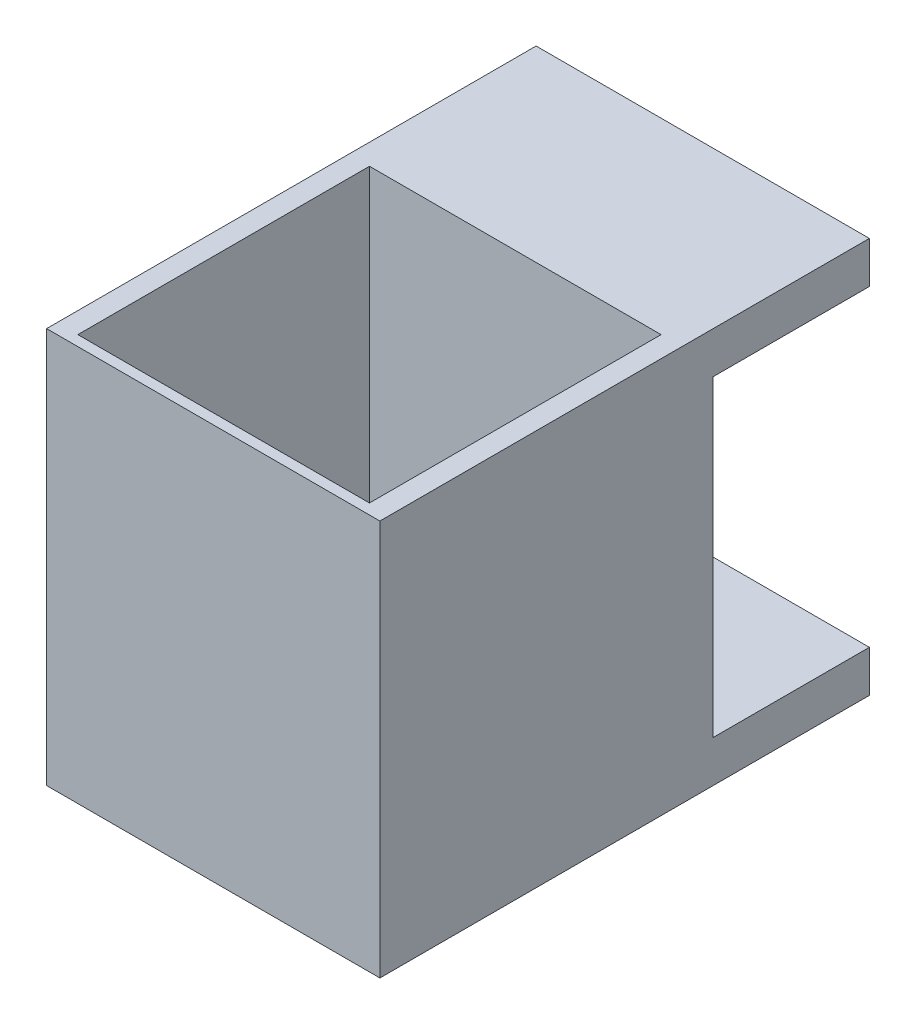
ISO-10303-21;
HEADER;
FILE_DESCRIPTION(('STEP AP214'),'2;1');
FILE_NAME('part.step','',(''),(''),'','','');
FILE_SCHEMA(('AUTOMOTIVE_DESIGN { 1 0 10303 214 1 1 1 1 }'));
ENDSEC;
DATA;
#1=APPLICATION_CONTEXT('core data for automotive mechanical design processes');
#2=APPLICATION_PROTOCOL_DEFINITION('international standard','automotive_design',2000,#1);
#3=PRODUCT_CONTEXT('',#1,'mechanical');
#4=PRODUCT('Part','Part','',(#3));
#5=PRODUCT_RELATED_PRODUCT_CATEGORY('part','',(#4));
#6=PRODUCT_DEFINITION_FORMATION('','',#4);
#7=PRODUCT_DEFINITION_CONTEXT('part definition',#1,'design');
#8=PRODUCT_DEFINITION('design','',#6,#7);
#9=PRODUCT_DEFINITION_SHAPE('','',#8);
#10=(LENGTH_UNIT() NAMED_UNIT(*) SI_UNIT(.MILLI.,.METRE.));
#11=(NAMED_UNIT(*) PLANE_ANGLE_UNIT() SI_UNIT($,.RADIAN.));
#12=(NAMED_UNIT(*) SI_UNIT($,.STERADIAN.) SOLID_ANGLE_UNIT());
#13=UNCERTAINTY_MEASURE_WITH_UNIT(LENGTH_MEASURE(1.E-05),#10,'distance_accuracy_value','');
#14=(GEOMETRIC_REPRESENTATION_CONTEXT(3) GLOBAL_UNCERTAINTY_ASSIGNED_CONTEXT((#13)) GLOBAL_UNIT_ASSIGNED_CONTEXT((#10,
#11,#12)) REPRESENTATION_CONTEXT('',''));
#15=CARTESIAN_POINT('',(0.,0.,0.));
#16=DIRECTION('',(0.,0.,1.));
#17=DIRECTION('',(1.,0.,0.));
#18=AXIS2_PLACEMENT_3D('',#15,#16,#17);
#19=CARTESIAN_POINT('',(16.,0.,-47.));
#20=DIRECTION('',(0.,1.,0.));
#21=DIRECTION('',(0.,0.,1.));
#22=AXIS2_PLACEMENT_3D('',#19,#20,#21);
#23=PLANE('',#22);
#24=DIRECTION('',(-1.,0.,0.));
#25=VECTOR('',#24,1.);
#26=CARTESIAN_POINT('',(-14.,0.,-29.));
#27=LINE('',#26,#25);
#28=CARTESIAN_POINT('',(14.,0.,-29.));
#29=VERTEX_POINT('',#28);
#30=CARTESIAN_POINT('',(-14.,0.,-29.));
#31=VERTEX_POINT('',#30);
#32=EDGE_CURVE('E128',#29,#31,#27,.T.);
#33=ORIENTED_EDGE('',*,*,#32,.T.);
#34=DIRECTION('',(0.,0.,1.));
#35=VECTOR('',#34,1.);
#36=CARTESIAN_POINT('',(-14.,0.,-29.));
#37=LINE('',#36,#35);
#38=CARTESIAN_POINT('',(-14.,0.,-1.));
#39=VERTEX_POINT('',#38);
#40=EDGE_CURVE('E122',#31,#39,#37,.T.);
#41=ORIENTED_EDGE('',*,*,#40,.T.);
#42=DIRECTION('',(1.,0.,0.));
#43=VECTOR('',#42,1.);
#44=CARTESIAN_POINT('',(-14.,0.,-1.));
#45=LINE('',#44,#43);
#46=CARTESIAN_POINT('',(14.,0.,-1.));
#47=VERTEX_POINT('',#46);
#48=EDGE_CURVE('E131',#39,#47,#45,.T.);
#49=ORIENTED_EDGE('',*,*,#48,.T.);
#50=DIRECTION('',(0.,0.,-1.));
#51=VECTOR('',#50,1.);
#52=CARTESIAN_POINT('',(14.,0.,-29.));
#53=LINE('',#52,#51);
#54=EDGE_CURVE('E46',#47,#29,#53,.T.);
#55=ORIENTED_EDGE('',*,*,#54,.T.);
#56=EDGE_LOOP('',(#33,#41,#49,#55));
#57=FACE_BOUND('',#56,.T.);
#58=DIRECTION('',(0.,0.,-1.));
#59=VECTOR('',#58,1.);
#60=CARTESIAN_POINT('',(-16.,0.,-47.));
#61=LINE('',#60,#59);
#62=CARTESIAN_POINT('',(-16.,0.,0.));
#63=VERTEX_POINT('',#62);
#64=CARTESIAN_POINT('',(-16.,0.,-47.));
#65=VERTEX_POINT('',#64);
#66=EDGE_CURVE('E156',#63,#65,#61,.T.);
#67=ORIENTED_EDGE('',*,*,#66,.T.);
#68=DIRECTION('',(-1.,0.,0.));
#69=VECTOR('',#68,1.);
#70=CARTESIAN_POINT('',(16.,0.,-47.));
#71=LINE('',#70,#69);
#72=CARTESIAN_POINT('',(16.,0.,-47.));
#73=VERTEX_POINT('',#72);
#74=EDGE_CURVE('E11',#73,#65,#71,.T.);
#75=ORIENTED_EDGE('',*,*,#74,.F.);
#76=DIRECTION('',(0.,0.,-1.));
#77=VECTOR('',#76,1.);
#78=CARTESIAN_POINT('',(16.,0.,-47.));
#79=LINE('',#78,#77);
#80=CARTESIAN_POINT('',(16.,0.,0.));
#81=VERTEX_POINT('',#80);
#82=EDGE_CURVE('E160',#81,#73,#79,.T.);
#83=ORIENTED_EDGE('',*,*,#82,.F.);
#84=DIRECTION('',(-1.,0.,0.));
#85=VECTOR('',#84,1.);
#86=CARTESIAN_POINT('',(16.,0.,0.));
#87=LINE('',#86,#85);
#88=EDGE_CURVE('E178',#81,#63,#87,.T.);
#89=ORIENTED_EDGE('',*,*,#88,.T.);
#90=EDGE_LOOP('',(#67,#75,#83,#89));
#91=FACE_BOUND('',#90,.T.);
#92=ADVANCED_FACE('F32',(#57,#91),#23,.F.);
#93=CARTESIAN_POINT('',(16.,4.,-47.));
#94=DIRECTION('',(0.,0.,1.));
#95=DIRECTION('',(1.,0.,0.));
#96=AXIS2_PLACEMENT_3D('',#93,#94,#95);
#97=PLANE('',#96);
#98=CARTESIAN_POINT('',(0.,2.00000000000008,-47.0000000000001));
#99=DIRECTION('',(0.,0.,-1.));
#100=DIRECTION('',(-1.,0.,0.));
#101=AXIS2_PLACEMENT_3D('',#98,#99,#100);
#102=CIRCLE('',#101,1.);
#103=CARTESIAN_POINT('',(-1.,2.00000000000008,-47.0000000000001));
#104=VERTEX_POINT('',#103);
#105=EDGE_CURVE('E407',#104,#104,#102,.T.);
#106=ORIENTED_EDGE('',*,*,#105,.F.);
#107=EDGE_LOOP('',(#106));
#108=FACE_BOUND('',#107,.T.);
#109=DIRECTION('',(0.,1.,0.));
#110=VECTOR('',#109,1.);
#111=CARTESIAN_POINT('',(-16.,4.,-47.));
#112=LINE('',#111,#110);
#113=CARTESIAN_POINT('',(-16.,4.,-47.));
#114=VERTEX_POINT('',#113);
#115=EDGE_CURVE('E181',#65,#114,#112,.T.);
#116=ORIENTED_EDGE('',*,*,#115,.T.);
#117=DIRECTION('',(-1.,0.,0.));
#118=VECTOR('',#117,1.);
#119=CARTESIAN_POINT('',(16.,4.,-47.));
#120=LINE('',#119,#118);
#121=CARTESIAN_POINT('',(16.,4.,-47.));
#122=VERTEX_POINT('',#121);
#123=EDGE_CURVE('E39',#122,#114,#120,.T.);
#124=ORIENTED_EDGE('',*,*,#123,.F.);
#125=DIRECTION('',(0.,1.,0.));
#126=VECTOR('',#125,1.);
#127=CARTESIAN_POINT('',(16.,4.,-47.));
#128=LINE('',#127,#126);
#129=EDGE_CURVE('E163',#73,#122,#128,.T.);
#130=ORIENTED_EDGE('',*,*,#129,.F.);
#131=ORIENTED_EDGE('',*,*,#74,.T.);
#132=EDGE_LOOP('',(#116,#124,#130,#131));
#133=FACE_BOUND('',#132,.T.);
#134=ADVANCED_FACE('F238',(#108,#133),#97,.F.);
#135=CARTESIAN_POINT('',(16.,4.,-32.));
#136=DIRECTION('',(0.,-1.,0.));
#137=DIRECTION('',(0.,0.,-1.));
#138=AXIS2_PLACEMENT_3D('',#135,#136,#137);
#139=PLANE('',#138);
#140=DIRECTION('',(0.,0.,1.));
#141=VECTOR('',#140,1.);
#142=CARTESIAN_POINT('',(-16.,4.,-32.));
#143=LINE('',#142,#141);
#144=CARTESIAN_POINT('',(-16.,4.,-32.));
#145=VERTEX_POINT('',#144);
#146=EDGE_CURVE('E183',#114,#145,#143,.T.);
#147=ORIENTED_EDGE('',*,*,#146,.T.);
#148=DIRECTION('',(-1.,0.,0.));
#149=VECTOR('',#148,1.);
#150=CARTESIAN_POINT('',(16.,4.,-32.));
#151=LINE('',#150,#149);
#152=CARTESIAN_POINT('',(16.,4.,-32.));
#153=VERTEX_POINT('',#152);
#154=EDGE_CURVE('E208',#153,#145,#151,.T.);
#155=ORIENTED_EDGE('',*,*,#154,.F.);
#156=DIRECTION('',(0.,0.,1.));
#157=VECTOR('',#156,1.);
#158=CARTESIAN_POINT('',(16.,4.,-32.));
#159=LINE('',#158,#157);
#160=EDGE_CURVE('E166',#122,#153,#159,.T.);
#161=ORIENTED_EDGE('',*,*,#160,.F.);
#162=ORIENTED_EDGE('',*,*,#123,.T.);
#163=EDGE_LOOP('',(#147,#155,#161,#162));
#164=FACE_BOUND('',#163,.T.);
#165=ADVANCED_FACE('F215',(#164),#139,.F.);
#166=CARTESIAN_POINT('',(16.,34.,-32.));
#167=DIRECTION('',(0.,0.,1.));
#168=DIRECTION('',(1.,0.,0.));
#169=AXIS2_PLACEMENT_3D('',#166,#167,#168);
#170=PLANE('',#169);
#171=DIRECTION('',(0.,1.,0.));
#172=VECTOR('',#171,1.);
#173=CARTESIAN_POINT('',(-16.,34.,-32.));
#174=LINE('',#173,#172);
#175=CARTESIAN_POINT('',(-16.,34.,-32.));
#176=VERTEX_POINT('',#175);
#177=EDGE_CURVE('E185',#145,#176,#174,.T.);
#178=ORIENTED_EDGE('',*,*,#177,.T.);
#179=DIRECTION('',(-1.,0.,0.));
#180=VECTOR('',#179,1.);
#181=CARTESIAN_POINT('',(16.,34.,-32.));
#182=LINE('',#181,#180);
#183=CARTESIAN_POINT('',(16.,34.,-32.));
#184=VERTEX_POINT('',#183);
#185=EDGE_CURVE('E205',#184,#176,#182,.T.);
#186=ORIENTED_EDGE('',*,*,#185,.F.);
#187=DIRECTION('',(0.,1.,0.));
#188=VECTOR('',#187,1.);
#189=CARTESIAN_POINT('',(16.,34.,-32.));
#190=LINE('',#189,#188);
#191=EDGE_CURVE('E168',#153,#184,#190,.T.);
#192=ORIENTED_EDGE('',*,*,#191,.F.);
#193=ORIENTED_EDGE('',*,*,#154,.T.);
#194=EDGE_LOOP('',(#178,#186,#192,#193));
#195=FACE_BOUND('',#194,.T.);
#196=ADVANCED_FACE('F226',(#195),#170,.F.);
#197=CARTESIAN_POINT('',(16.,34.,-47.));
#198=DIRECTION('',(0.,1.,0.));
#199=DIRECTION('',(0.,0.,1.));
#200=AXIS2_PLACEMENT_3D('',#197,#198,#199);
#201=PLANE('',#200);
#202=DIRECTION('',(0.,0.,-1.));
#203=VECTOR('',#202,1.);
#204=CARTESIAN_POINT('',(-16.,34.,-47.));
#205=LINE('',#204,#203);
#206=CARTESIAN_POINT('',(-16.,34.,-47.));
#207=VERTEX_POINT('',#206);
#208=EDGE_CURVE('E187',#176,#207,#205,.T.);
#209=ORIENTED_EDGE('',*,*,#208,.T.);
#210=DIRECTION('',(-1.,0.,0.));
#211=VECTOR('',#210,1.);
#212=CARTESIAN_POINT('',(16.,34.,-47.));
#213=LINE('',#212,#211);
#214=CARTESIAN_POINT('',(16.,34.,-47.));
#215=VERTEX_POINT('',#214);
#216=EDGE_CURVE('E202',#215,#207,#213,.T.);
#217=ORIENTED_EDGE('',*,*,#216,.F.);
#218=DIRECTION('',(0.,0.,-1.));
#219=VECTOR('',#218,1.);
#220=CARTESIAN_POINT('',(16.,34.,-47.));
#221=LINE('',#220,#219);
#222=EDGE_CURVE('E170',#184,#215,#221,.T.);
#223=ORIENTED_EDGE('',*,*,#222,.F.);
#224=ORIENTED_EDGE('',*,*,#185,.T.);
#225=EDGE_LOOP('',(#209,#217,#223,#224));
#226=FACE_BOUND('',#225,.T.);
#227=ADVANCED_FACE('F230',(#226),#201,.F.);
#228=CARTESIAN_POINT('',(16.,38.,-47.));
#229=DIRECTION('',(0.,0.,1.));
#230=DIRECTION('',(0.,-1.,0.));
#231=AXIS2_PLACEMENT_3D('',#228,#229,#230);
#232=PLANE('',#231);
#233=CARTESIAN_POINT('',(0.,36.0000000000001,-47.0000000000001));
#234=DIRECTION('',(0.,0.,-1.));
#235=DIRECTION('',(-1.,0.,0.));
#236=AXIS2_PLACEMENT_3D('',#233,#234,#235);
#237=CIRCLE('',#236,1.);
#238=CARTESIAN_POINT('',(-1.,36.0000000000001,-47.0000000000001));
#239=VERTEX_POINT('',#238);
#240=EDGE_CURVE('E143',#239,#239,#237,.T.);
#241=ORIENTED_EDGE('',*,*,#240,.F.);
#242=EDGE_LOOP('',(#241));
#243=FACE_BOUND('',#242,.T.);
#244=DIRECTION('',(0.,1.,0.));
#245=VECTOR('',#244,1.);
#246=CARTESIAN_POINT('',(-16.,38.,-47.));
#247=LINE('',#246,#245);
#248=CARTESIAN_POINT('',(-16.,38.,-47.));
#249=VERTEX_POINT('',#248);
#250=EDGE_CURVE('E189',#207,#249,#247,.T.);
#251=ORIENTED_EDGE('',*,*,#250,.T.);
#252=DIRECTION('',(-1.,0.,0.));
#253=VECTOR('',#252,1.);
#254=CARTESIAN_POINT('',(16.,38.,-47.));
#255=LINE('',#254,#253);
#256=CARTESIAN_POINT('',(16.,38.,-47.));
#257=VERTEX_POINT('',#256);
#258=EDGE_CURVE('E199',#257,#249,#255,.T.);
#259=ORIENTED_EDGE('',*,*,#258,.F.);
#260=DIRECTION('',(0.,1.,0.));
#261=VECTOR('',#260,1.);
#262=CARTESIAN_POINT('',(16.,38.,-47.));
#263=LINE('',#262,#261);
#264=EDGE_CURVE('E172',#215,#257,#263,.T.);
#265=ORIENTED_EDGE('',*,*,#264,.F.);
#266=ORIENTED_EDGE('',*,*,#216,.T.);
#267=EDGE_LOOP('',(#251,#259,#265,#266));
#268=FACE_BOUND('',#267,.T.);
#269=ADVANCED_FACE('F250',(#243,#268),#232,.F.);
#270=CARTESIAN_POINT('',(16.,38.,0.));
#271=DIRECTION('',(0.,-1.,0.));
#272=DIRECTION('',(0.,0.,-1.));
#273=AXIS2_PLACEMENT_3D('',#270,#271,#272);
#274=PLANE('',#273);
#275=DIRECTION('',(1.,0.,0.));
#276=VECTOR('',#275,1.);
#277=CARTESIAN_POINT('',(-14.,38.,-1.));
#278=LINE('',#277,#276);
#279=CARTESIAN_POINT('',(-14.,38.,-1.));
#280=VERTEX_POINT('',#279);
#281=CARTESIAN_POINT('',(14.,38.,-1.));
#282=VERTEX_POINT('',#281);
#283=EDGE_CURVE('E149',#280,#282,#278,.T.);
#284=ORIENTED_EDGE('',*,*,#283,.F.);
#285=DIRECTION('',(0.,0.,1.));
#286=VECTOR('',#285,1.);
#287=CARTESIAN_POINT('',(-14.,38.,-29.));
#288=LINE('',#287,#286);
#289=CARTESIAN_POINT('',(-14.,38.,-29.));
#290=VERTEX_POINT('',#289);
#291=EDGE_CURVE('E54',#290,#280,#288,.T.);
#292=ORIENTED_EDGE('',*,*,#291,.F.);
#293=DIRECTION('',(-1.,0.,0.));
#294=VECTOR('',#293,1.);
#295=CARTESIAN_POINT('',(-14.,38.,-29.));
#296=LINE('',#295,#294);
#297=CARTESIAN_POINT('',(14.,38.,-29.));
#298=VERTEX_POINT('',#297);
#299=EDGE_CURVE('E137',#298,#290,#296,.T.);
#300=ORIENTED_EDGE('',*,*,#299,.F.);
#301=DIRECTION('',(0.,0.,-1.));
#302=VECTOR('',#301,1.);
#303=CARTESIAN_POINT('',(14.,38.,-29.));
#304=LINE('',#303,#302);
#305=EDGE_CURVE('E140',#282,#298,#304,.T.);
#306=ORIENTED_EDGE('',*,*,#305,.F.);
#307=EDGE_LOOP('',(#284,#292,#300,#306));
#308=FACE_BOUND('',#307,.T.);
#309=DIRECTION('',(0.,0.,1.));
#310=VECTOR('',#309,1.);
#311=CARTESIAN_POINT('',(-16.,38.,0.));
#312=LINE('',#311,#310);
#313=CARTESIAN_POINT('',(-16.,38.,0.));
#314=VERTEX_POINT('',#313);
#315=EDGE_CURVE('E191',#249,#314,#312,.T.);
#316=ORIENTED_EDGE('',*,*,#315,.T.);
#317=DIRECTION('',(-1.,0.,0.));
#318=VECTOR('',#317,1.);
#319=CARTESIAN_POINT('',(16.,38.,0.));
#320=LINE('',#319,#318);
#321=CARTESIAN_POINT('',(16.,38.,0.));
#322=VERTEX_POINT('',#321);
#323=EDGE_CURVE('E196',#322,#314,#320,.T.);
#324=ORIENTED_EDGE('',*,*,#323,.F.);
#325=DIRECTION('',(0.,0.,1.));
#326=VECTOR('',#325,1.);
#327=CARTESIAN_POINT('',(16.,38.,0.));
#328=LINE('',#327,#326);
#329=EDGE_CURVE('E174',#257,#322,#328,.T.);
#330=ORIENTED_EDGE('',*,*,#329,.F.);
#331=ORIENTED_EDGE('',*,*,#258,.T.);
#332=EDGE_LOOP('',(#316,#324,#330,#331));
#333=FACE_BOUND('',#332,.T.);
#334=ADVANCED_FACE('F248',(#308,#333),#274,.F.);
#335=CARTESIAN_POINT('',(16.,0.,0.));
#336=DIRECTION('',(0.,0.,-1.));
#337=DIRECTION('',(-1.,0.,0.));
#338=AXIS2_PLACEMENT_3D('',#335,#336,#337);
#339=PLANE('',#338);
#340=DIRECTION('',(0.,-1.,0.));
#341=VECTOR('',#340,1.);
#342=CARTESIAN_POINT('',(-16.,0.,0.));
#343=LINE('',#342,#341);
#344=EDGE_CURVE('E164',#314,#63,#343,.T.);
#345=ORIENTED_EDGE('',*,*,#344,.T.);
#346=ORIENTED_EDGE('',*,*,#88,.F.);
#347=DIRECTION('',(0.,-1.,0.));
#348=VECTOR('',#347,1.);
#349=CARTESIAN_POINT('',(16.,0.,0.));
#350=LINE('',#349,#348);
#351=EDGE_CURVE('E176',#322,#81,#350,.T.);
#352=ORIENTED_EDGE('',*,*,#351,.F.);
#353=ORIENTED_EDGE('',*,*,#323,.T.);
#354=EDGE_LOOP('',(#345,#346,#352,#353));
#355=FACE_BOUND('',#354,.T.);
#356=ADVANCED_FACE('F243',(#355),#339,.F.);
#357=CARTESIAN_POINT('',(16.,0.,0.));
#358=DIRECTION('',(-1.,0.,0.));
#359=DIRECTION('',(0.,0.,1.));
#360=AXIS2_PLACEMENT_3D('',#357,#358,#359);
#361=PLANE('',#360);
#362=ORIENTED_EDGE('',*,*,#82,.T.);
#363=ORIENTED_EDGE('',*,*,#129,.T.);
#364=ORIENTED_EDGE('',*,*,#160,.T.);
#365=ORIENTED_EDGE('',*,*,#191,.T.);
#366=ORIENTED_EDGE('',*,*,#222,.T.);
#367=ORIENTED_EDGE('',*,*,#264,.T.);
#368=ORIENTED_EDGE('',*,*,#329,.T.);
#369=ORIENTED_EDGE('',*,*,#351,.T.);
#370=EDGE_LOOP('',(#362,#363,#364,#365,#366,#367,#368,#369));
#371=FACE_BOUND('',#370,.T.);
#372=ADVANCED_FACE('F234',(#371),#361,.F.);
#373=CARTESIAN_POINT('',(-16.,0.,0.));
#374=DIRECTION('',(-1.,0.,0.));
#375=DIRECTION('',(0.,0.,1.));
#376=AXIS2_PLACEMENT_3D('',#373,#374,#375);
#377=PLANE('',#376);
#378=ORIENTED_EDGE('',*,*,#66,.F.);
#379=ORIENTED_EDGE('',*,*,#344,.F.);
#380=ORIENTED_EDGE('',*,*,#315,.F.);
#381=ORIENTED_EDGE('',*,*,#250,.F.);
#382=ORIENTED_EDGE('',*,*,#208,.F.);
#383=ORIENTED_EDGE('',*,*,#177,.F.);
#384=ORIENTED_EDGE('',*,*,#146,.F.);
#385=ORIENTED_EDGE('',*,*,#115,.F.);
#386=EDGE_LOOP('',(#378,#379,#380,#381,#382,#383,#384,#385));
#387=FACE_BOUND('',#386,.T.);
#388=ADVANCED_FACE('F221',(#387),#377,.T.);
#389=CARTESIAN_POINT('',(-14.,0.,-29.));
#390=DIRECTION('',(-1.,0.,0.));
#391=DIRECTION('',(0.,0.,1.));
#392=AXIS2_PLACEMENT_3D('',#389,#390,#391);
#393=PLANE('',#392);
#394=ORIENTED_EDGE('',*,*,#291,.T.);
#395=DIRECTION('',(0.,1.,0.));
#396=VECTOR('',#395,1.);
#397=CARTESIAN_POINT('',(-14.,0.,-1.));
#398=LINE('',#397,#396);
#399=EDGE_CURVE('E118',#39,#280,#398,.T.);
#400=ORIENTED_EDGE('',*,*,#399,.F.);
#401=ORIENTED_EDGE('',*,*,#40,.F.);
#402=DIRECTION('',(0.,1.,0.));
#403=VECTOR('',#402,1.);
#404=CARTESIAN_POINT('',(-14.,0.,-29.));
#405=LINE('',#404,#403);
#406=EDGE_CURVE('E154',#31,#290,#405,.T.);
#407=ORIENTED_EDGE('',*,*,#406,.T.);
#408=EDGE_LOOP('',(#394,#400,#401,#407));
#409=FACE_BOUND('',#408,.T.);
#410=ADVANCED_FACE('F120',(#409),#393,.F.);
#411=CARTESIAN_POINT('',(-14.,0.,-29.));
#412=DIRECTION('',(0.,0.,-1.));
#413=DIRECTION('',(-1.,0.,0.));
#414=AXIS2_PLACEMENT_3D('',#411,#412,#413);
#415=PLANE('',#414);
#416=ORIENTED_EDGE('',*,*,#299,.T.);
#417=ORIENTED_EDGE('',*,*,#406,.F.);
#418=ORIENTED_EDGE('',*,*,#32,.F.);
#419=DIRECTION('',(0.,1.,0.));
#420=VECTOR('',#419,1.);
#421=CARTESIAN_POINT('',(14.,0.,-29.));
#422=LINE('',#421,#420);
#423=EDGE_CURVE('E157',#29,#298,#422,.T.);
#424=ORIENTED_EDGE('',*,*,#423,.T.);
#425=EDGE_LOOP('',(#416,#417,#418,#424));
#426=FACE_BOUND('',#425,.T.);
#427=ADVANCED_FACE('F327',(#426),#415,.F.);
#428=CARTESIAN_POINT('',(14.,0.,-29.));
#429=DIRECTION('',(1.,0.,0.));
#430=DIRECTION('',(0.,0.,-1.));
#431=AXIS2_PLACEMENT_3D('',#428,#429,#430);
#432=PLANE('',#431);
#433=ORIENTED_EDGE('',*,*,#305,.T.);
#434=ORIENTED_EDGE('',*,*,#423,.F.);
#435=ORIENTED_EDGE('',*,*,#54,.F.);
#436=DIRECTION('',(0.,1.,0.));
#437=VECTOR('',#436,1.);
#438=CARTESIAN_POINT('',(14.,0.,-1.));
#439=LINE('',#438,#437);
#440=EDGE_CURVE('E127',#47,#282,#439,.T.);
#441=ORIENTED_EDGE('',*,*,#440,.T.);
#442=EDGE_LOOP('',(#433,#434,#435,#441));
#443=FACE_BOUND('',#442,.T.);
#444=ADVANCED_FACE('F336',(#443),#432,.F.);
#445=CARTESIAN_POINT('',(-14.,0.,-1.));
#446=DIRECTION('',(0.,0.,1.));
#447=DIRECTION('',(1.,0.,0.));
#448=AXIS2_PLACEMENT_3D('',#445,#446,#447);
#449=PLANE('',#448);
#450=ORIENTED_EDGE('',*,*,#283,.T.);
#451=ORIENTED_EDGE('',*,*,#440,.F.);
#452=ORIENTED_EDGE('',*,*,#48,.F.);
#453=ORIENTED_EDGE('',*,*,#399,.T.);
#454=EDGE_LOOP('',(#450,#451,#452,#453));
#455=FACE_BOUND('',#454,.T.);
#456=ADVANCED_FACE('F132',(#455),#449,.F.);
#457=CARTESIAN_POINT('',(0.,36.0000000000001,-45.0000000000001));
#458=DIRECTION('',(0.,0.,-1.));
#459=DIRECTION('',(-1.,0.,0.));
#460=AXIS2_PLACEMENT_3D('',#457,#458,#459);
#461=CYLINDRICAL_SURFACE('',#460,1.);
#462=CARTESIAN_POINT('',(0.,36.0000000000001,-45.0000000000001));
#463=DIRECTION('',(0.,0.,-1.));
#464=DIRECTION('',(-1.,0.,0.));
#465=AXIS2_PLACEMENT_3D('',#462,#463,#464);
#466=CIRCLE('',#465,1.);
#467=CARTESIAN_POINT('',(-1.,36.0000000000001,-45.0000000000001));
#468=VERTEX_POINT('',#467);
#469=EDGE_CURVE('E150',#468,#468,#466,.T.);
#470=ORIENTED_EDGE('',*,*,#469,.F.);
#471=EDGE_LOOP('',(#470));
#472=FACE_BOUND('',#471,.T.);
#473=ORIENTED_EDGE('',*,*,#240,.T.);
#474=EDGE_LOOP('',(#473));
#475=FACE_BOUND('',#474,.T.);
#476=ADVANCED_FACE('F353',(#472,#475),#461,.F.);
#477=CARTESIAN_POINT('',(0.,36.0000000000001,-45.0000000000001));
#478=DIRECTION('',(0.,0.,-1.));
#479=DIRECTION('',(-1.,0.,0.));
#480=AXIS2_PLACEMENT_3D('',#477,#478,#479);
#481=PLANE('',#480);
#482=ORIENTED_EDGE('',*,*,#469,.T.);
#483=EDGE_LOOP('',(#482));
#484=FACE_BOUND('',#483,.T.);
#485=ADVANCED_FACE('F370',(#484),#481,.T.);
#486=CARTESIAN_POINT('',(0.,2.00000000000008,-45.0000000000001));
#487=DIRECTION('',(0.,0.,-1.));
#488=DIRECTION('',(-1.,0.,0.));
#489=AXIS2_PLACEMENT_3D('',#486,#487,#488);
#490=CYLINDRICAL_SURFACE('',#489,1.);
#491=CARTESIAN_POINT('',(0.,2.00000000000008,-45.0000000000001));
#492=DIRECTION('',(0.,0.,-1.));
#493=DIRECTION('',(-1.,0.,0.));
#494=AXIS2_PLACEMENT_3D('',#491,#492,#493);
#495=CIRCLE('',#494,1.);
#496=CARTESIAN_POINT('',(-1.,2.00000000000008,-45.0000000000001));
#497=VERTEX_POINT('',#496);
#498=EDGE_CURVE('E406',#497,#497,#495,.T.);
#499=ORIENTED_EDGE('',*,*,#498,.F.);
#500=EDGE_LOOP('',(#499));
#501=FACE_BOUND('',#500,.T.);
#502=ORIENTED_EDGE('',*,*,#105,.T.);
#503=EDGE_LOOP('',(#502));
#504=FACE_BOUND('',#503,.T.);
#505=ADVANCED_FACE('F380',(#501,#504),#490,.F.);
#506=CARTESIAN_POINT('',(0.,2.00000000000008,-45.0000000000001));
#507=DIRECTION('',(0.,0.,-1.));
#508=DIRECTION('',(-1.,0.,0.));
#509=AXIS2_PLACEMENT_3D('',#506,#507,#508);
#510=PLANE('',#509);
#511=ORIENTED_EDGE('',*,*,#498,.T.);
#512=EDGE_LOOP('',(#511));
#513=FACE_BOUND('',#512,.T.);
#514=ADVANCED_FACE('F390',(#513),#510,.T.);
#515=CLOSED_SHELL('',(#92,#134,#165,#196,#227,#269,#334,#356,#372,#388,#410,#427,#444,#456,#476,
#485,#505,#514));
#516=MANIFOLD_SOLID_BREP('B2',#515);
#517=ADVANCED_BREP_SHAPE_REPRESENTATION('',(#18,#516),#14);
#518=SHAPE_DEFINITION_REPRESENTATION(#9,#517);
ENDSEC;
END-ISO-10303-21;
